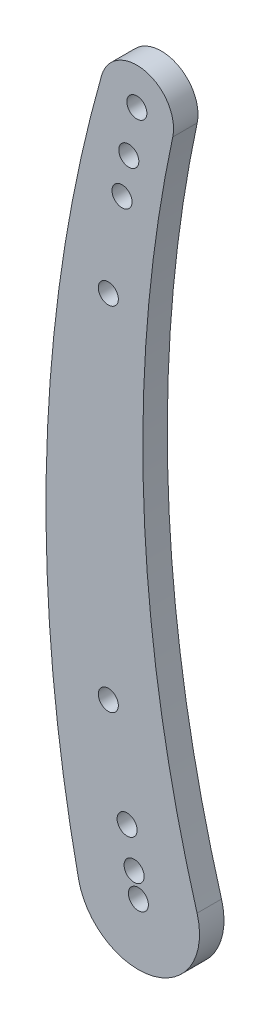
ISO-10303-21;
HEADER;
FILE_DESCRIPTION(('STEP AP214'),'2;1');
FILE_NAME('part.step','',(''),(''),'','','');
FILE_SCHEMA(('AUTOMOTIVE_DESIGN { 1 0 10303 214 1 1 1 1 }'));
ENDSEC;
DATA;
#1=APPLICATION_CONTEXT('core data for automotive mechanical design processes');
#2=APPLICATION_PROTOCOL_DEFINITION('international standard','automotive_design',2000,#1);
#3=PRODUCT_CONTEXT('',#1,'mechanical');
#4=PRODUCT('Part','Part','',(#3));
#5=PRODUCT_RELATED_PRODUCT_CATEGORY('part','',(#4));
#6=PRODUCT_DEFINITION_FORMATION('','',#4);
#7=PRODUCT_DEFINITION_CONTEXT('part definition',#1,'design');
#8=PRODUCT_DEFINITION('design','',#6,#7);
#9=PRODUCT_DEFINITION_SHAPE('','',#8);
#10=(LENGTH_UNIT() NAMED_UNIT(*) SI_UNIT(.MILLI.,.METRE.));
#11=(NAMED_UNIT(*) PLANE_ANGLE_UNIT() SI_UNIT($,.RADIAN.));
#12=(NAMED_UNIT(*) SI_UNIT($,.STERADIAN.) SOLID_ANGLE_UNIT());
#13=UNCERTAINTY_MEASURE_WITH_UNIT(LENGTH_MEASURE(1.E-05),#10,'distance_accuracy_value','');
#14=(GEOMETRIC_REPRESENTATION_CONTEXT(3) GLOBAL_UNCERTAINTY_ASSIGNED_CONTEXT((#13)) GLOBAL_UNIT_ASSIGNED_CONTEXT((#10,
#11,#12)) REPRESENTATION_CONTEXT('',''));
#15=CARTESIAN_POINT('',(0.,0.,0.));
#16=DIRECTION('',(0.,0.,1.));
#17=DIRECTION('',(1.,0.,0.));
#18=AXIS2_PLACEMENT_3D('',#15,#16,#17);
#19=CARTESIAN_POINT('',(137.957829025341,40.3943054231007,5.));
#20=DIRECTION('',(0.,0.,1.));
#21=DIRECTION('',(1.,0.,0.));
#22=AXIS2_PLACEMENT_3D('',#19,#20,#21);
#23=PLANE('',#22);
#24=CARTESIAN_POINT('',(-0.872956087167781,4.57842074080973,5.));
#25=DIRECTION('',(0.,0.,1.));
#26=DIRECTION('',(1.,0.,0.));
#27=AXIS2_PLACEMENT_3D('',#24,#25,#26);
#28=CIRCLE('',#27,2.04999999999999);
#29=CARTESIAN_POINT('',(1.17704391283221,4.57842074080973,5.));
#30=VERTEX_POINT('',#29);
#31=EDGE_CURVE('E157',#30,#30,#28,.T.);
#32=ORIENTED_EDGE('',*,*,#31,.F.);
#33=EDGE_LOOP('',(#32));
#34=FACE_BOUND('',#33,.T.);
#35=CARTESIAN_POINT('',(-2.30013225147478,12.0635772652943,5.));
#36=DIRECTION('',(0.,0.,1.));
#37=DIRECTION('',(1.,0.,0.));
#38=AXIS2_PLACEMENT_3D('',#35,#36,#37);
#39=CIRCLE('',#38,2.04999999999999);
#40=CARTESIAN_POINT('',(-0.250132251474789,12.0635772652943,5.));
#41=VERTEX_POINT('',#40);
#42=EDGE_CURVE('E154',#41,#41,#39,.T.);
#43=ORIENTED_EDGE('',*,*,#42,.F.);
#44=EDGE_LOOP('',(#43));
#45=FACE_BOUND('',#44,.T.);
#46=CARTESIAN_POINT('',(-1.95909243415583,130.643984382173,5.));
#47=DIRECTION('',(0.,0.,1.));
#48=DIRECTION('',(1.,0.,0.));
#49=AXIS2_PLACEMENT_3D('',#46,#47,#48);
#50=CIRCLE('',#49,2.05);
#51=CARTESIAN_POINT('',(0.090907565844173,130.643984382173,5.));
#52=VERTEX_POINT('',#51);
#53=EDGE_CURVE('E141',#52,#52,#50,.T.);
#54=ORIENTED_EDGE('',*,*,#53,.F.);
#55=EDGE_LOOP('',(#54));
#56=FACE_BOUND('',#55,.T.);
#57=CARTESIAN_POINT('',(-3.34827785549131,122.765522358075,5.));
#58=DIRECTION('',(0.,0.,1.));
#59=DIRECTION('',(1.,0.,0.));
#60=AXIS2_PLACEMENT_3D('',#57,#58,#59);
#61=CIRCLE('',#60,2.05);
#62=CARTESIAN_POINT('',(-1.29827785549131,122.765522358075,5.));
#63=VERTEX_POINT('',#62);
#64=EDGE_CURVE('E142',#63,#63,#61,.T.);
#65=ORIENTED_EDGE('',*,*,#64,.F.);
#66=EDGE_LOOP('',(#65));
#67=FACE_BOUND('',#66,.T.);
#68=CARTESIAN_POINT('',(-6.14211543162091,32.2137494634089,5.));
#69=DIRECTION('',(0.,0.,1.));
#70=DIRECTION('',(1.,0.,0.));
#71=AXIS2_PLACEMENT_3D('',#68,#69,#70);
#72=CIRCLE('',#71,2.05);
#73=CARTESIAN_POINT('',(-4.09211543162091,32.2137494634089,5.));
#74=VERTEX_POINT('',#73);
#75=EDGE_CURVE('E138',#74,#74,#72,.T.);
#76=ORIENTED_EDGE('',*,*,#75,.F.);
#77=EDGE_LOOP('',(#76));
#78=FACE_BOUND('',#77,.T.);
#79=CARTESIAN_POINT('',(-6.14211543162091,104.166670734742,5.));
#80=DIRECTION('',(0.,0.,1.));
#81=DIRECTION('',(1.,0.,0.));
#82=AXIS2_PLACEMENT_3D('',#79,#80,#81);
#83=CIRCLE('',#82,2.05);
#84=CARTESIAN_POINT('',(-4.09211543162091,104.166670734742,5.));
#85=VERTEX_POINT('',#84);
#86=EDGE_CURVE('E132',#85,#85,#83,.T.);
#87=ORIENTED_EDGE('',*,*,#86,.F.);
#88=EDGE_LOOP('',(#87));
#89=FACE_BOUND('',#88,.T.);
#90=CARTESIAN_POINT('',(0.,0.,5.));
#91=DIRECTION('',(0.,0.,1.));
#92=DIRECTION('',(1.,0.,0.));
#93=AXIS2_PLACEMENT_3D('',#90,#91,#92);
#94=CIRCLE('',#93,2.05);
#95=CARTESIAN_POINT('',(2.05,0.,5.));
#96=VERTEX_POINT('',#95);
#97=EDGE_CURVE('E106',#96,#96,#94,.T.);
#98=ORIENTED_EDGE('',*,*,#97,.F.);
#99=EDGE_LOOP('',(#98));
#100=FACE_BOUND('',#99,.T.);
#101=CARTESIAN_POINT('',(275.915658050682,80.7886108462015,5.));
#102=DIRECTION('',(0.,0.,-1.));
#103=DIRECTION('',(1.,0.,0.));
#104=AXIS2_PLACEMENT_3D('',#101,#102,#103);
#105=CIRCLE('',#104,275.);
#106=CARTESIAN_POINT('',(11.9963329587253,3.51254829766093,5.));
#107=VERTEX_POINT('',#106);
#108=CARTESIAN_POINT('',(7.02397479696329,138.42768333164,5.));
#109=VERTEX_POINT('',#108);
#110=EDGE_CURVE('E91',#107,#109,#105,.T.);
#111=ORIENTED_EDGE('',*,*,#110,.T.);
#112=CARTESIAN_POINT('',(-0.309434746319955,139.999658035789,5.));
#113=DIRECTION('',(0.,0.,1.));
#114=DIRECTION('',(1.,0.,0.));
#115=AXIS2_PLACEMENT_3D('',#112,#113,#114);
#116=CIRCLE('',#115,7.5);
#117=CARTESIAN_POINT('',(-7.52539193567164,142.044153533814,5.));
#118=VERTEX_POINT('',#117);
#119=EDGE_CURVE('E86',#109,#118,#116,.T.);
#120=ORIENTED_EDGE('',*,*,#119,.T.);
#121=CARTESIAN_POINT('',(281.112895638395,60.2643336128175,5.));
#122=DIRECTION('',(0.,0.,1.));
#123=DIRECTION('',(1.,0.,0.));
#124=AXIS2_PLACEMENT_3D('',#121,#122,#123);
#125=CIRCLE('',#124,300.);
#126=CARTESIAN_POINT('',(-12.222299810365,-2.62018841794858,5.));
#127=VERTEX_POINT('',#126);
#128=EDGE_CURVE('E89',#118,#127,#125,.T.);
#129=ORIENTED_EDGE('',*,*,#128,.T.);
#130=CARTESIAN_POINT('',(0.,0.,5.));
#131=DIRECTION('',(0.,0.,1.));
#132=DIRECTION('',(1.,0.,0.));
#133=AXIS2_PLACEMENT_3D('',#130,#131,#132);
#134=CIRCLE('',#133,12.5);
#135=EDGE_CURVE('E56',#127,#107,#134,.T.);
#136=ORIENTED_EDGE('',*,*,#135,.T.);
#137=EDGE_LOOP('',(#111,#120,#129,#136));
#138=FACE_BOUND('',#137,.T.);
#139=CARTESIAN_POINT('',(-0.309434746319955,139.999658035789,5.));
#140=DIRECTION('',(0.,0.,1.));
#141=DIRECTION('',(1.,0.,0.));
#142=AXIS2_PLACEMENT_3D('',#139,#140,#141);
#143=CIRCLE('',#142,2.05);
#144=CARTESIAN_POINT('',(1.74056525368004,139.999658035789,5.));
#145=VERTEX_POINT('',#144);
#146=EDGE_CURVE('E121',#145,#145,#143,.T.);
#147=ORIENTED_EDGE('',*,*,#146,.F.);
#148=EDGE_LOOP('',(#147));
#149=FACE_BOUND('',#148,.T.);
#150=ADVANCED_FACE('F39',(#34,#45,#56,#67,#78,#89,#100,#138,#149),#23,.T.);
#151=CARTESIAN_POINT('',(137.957829025341,40.3943054231007,0.));
#152=DIRECTION('',(0.,0.,1.));
#153=DIRECTION('',(1.,0.,0.));
#154=AXIS2_PLACEMENT_3D('',#151,#152,#153);
#155=PLANE('',#154);
#156=CARTESIAN_POINT('',(-0.872956087167781,4.57842074080973,0.));
#157=DIRECTION('',(0.,0.,1.));
#158=DIRECTION('',(1.,0.,0.));
#159=AXIS2_PLACEMENT_3D('',#156,#157,#158);
#160=CIRCLE('',#159,2.04999999999999);
#161=CARTESIAN_POINT('',(1.17704391283221,4.57842074080973,0.));
#162=VERTEX_POINT('',#161);
#163=EDGE_CURVE('E149',#162,#162,#160,.F.);
#164=ORIENTED_EDGE('',*,*,#163,.F.);
#165=EDGE_LOOP('',(#164));
#166=FACE_BOUND('',#165,.T.);
#167=CARTESIAN_POINT('',(-2.30013225147478,12.0635772652943,0.));
#168=DIRECTION('',(0.,0.,1.));
#169=DIRECTION('',(1.,0.,0.));
#170=AXIS2_PLACEMENT_3D('',#167,#168,#169);
#171=CIRCLE('',#170,2.04999999999999);
#172=CARTESIAN_POINT('',(-0.250132251474789,12.0635772652943,0.));
#173=VERTEX_POINT('',#172);
#174=EDGE_CURVE('E158',#173,#173,#171,.F.);
#175=ORIENTED_EDGE('',*,*,#174,.F.);
#176=EDGE_LOOP('',(#175));
#177=FACE_BOUND('',#176,.T.);
#178=CARTESIAN_POINT('',(-1.95909243415583,130.643984382173,0.));
#179=DIRECTION('',(0.,0.,1.));
#180=DIRECTION('',(1.,0.,0.));
#181=AXIS2_PLACEMENT_3D('',#178,#179,#180);
#182=CIRCLE('',#181,2.05);
#183=CARTESIAN_POINT('',(0.090907565844173,130.643984382173,0.));
#184=VERTEX_POINT('',#183);
#185=EDGE_CURVE('E145',#184,#184,#182,.F.);
#186=ORIENTED_EDGE('',*,*,#185,.F.);
#187=EDGE_LOOP('',(#186));
#188=FACE_BOUND('',#187,.T.);
#189=CARTESIAN_POINT('',(-3.34827785549131,122.765522358075,0.));
#190=DIRECTION('',(0.,0.,1.));
#191=DIRECTION('',(1.,0.,0.));
#192=AXIS2_PLACEMENT_3D('',#189,#190,#191);
#193=CIRCLE('',#192,2.05);
#194=CARTESIAN_POINT('',(-1.29827785549131,122.765522358075,0.));
#195=VERTEX_POINT('',#194);
#196=EDGE_CURVE('E146',#195,#195,#193,.F.);
#197=ORIENTED_EDGE('',*,*,#196,.F.);
#198=EDGE_LOOP('',(#197));
#199=FACE_BOUND('',#198,.T.);
#200=CARTESIAN_POINT('',(-6.14211543162091,32.2137494634089,0.));
#201=DIRECTION('',(0.,0.,1.));
#202=DIRECTION('',(1.,0.,0.));
#203=AXIS2_PLACEMENT_3D('',#200,#201,#202);
#204=CIRCLE('',#203,2.05);
#205=CARTESIAN_POINT('',(-4.09211543162091,32.2137494634089,0.));
#206=VERTEX_POINT('',#205);
#207=EDGE_CURVE('E135',#206,#206,#204,.F.);
#208=ORIENTED_EDGE('',*,*,#207,.F.);
#209=EDGE_LOOP('',(#208));
#210=FACE_BOUND('',#209,.T.);
#211=CARTESIAN_POINT('',(-6.14211543162091,104.166670734742,0.));
#212=DIRECTION('',(0.,0.,1.));
#213=DIRECTION('',(1.,0.,0.));
#214=AXIS2_PLACEMENT_3D('',#211,#212,#213);
#215=CIRCLE('',#214,2.05);
#216=CARTESIAN_POINT('',(-4.09211543162091,104.166670734742,0.));
#217=VERTEX_POINT('',#216);
#218=EDGE_CURVE('E127',#217,#217,#215,.F.);
#219=ORIENTED_EDGE('',*,*,#218,.F.);
#220=EDGE_LOOP('',(#219));
#221=FACE_BOUND('',#220,.T.);
#222=CARTESIAN_POINT('',(275.915658050682,80.7886108462015,0.));
#223=DIRECTION('',(0.,0.,-1.));
#224=DIRECTION('',(1.,0.,0.));
#225=AXIS2_PLACEMENT_3D('',#222,#223,#224);
#226=CIRCLE('',#225,275.);
#227=CARTESIAN_POINT('',(11.9963329587253,3.51254829766093,0.));
#228=VERTEX_POINT('',#227);
#229=CARTESIAN_POINT('',(7.02397479696329,138.42768333164,0.));
#230=VERTEX_POINT('',#229);
#231=EDGE_CURVE('E103',#228,#230,#226,.T.);
#232=ORIENTED_EDGE('',*,*,#231,.F.);
#233=CARTESIAN_POINT('',(0.,0.,0.));
#234=DIRECTION('',(0.,0.,1.));
#235=DIRECTION('',(1.,0.,0.));
#236=AXIS2_PLACEMENT_3D('',#233,#234,#235);
#237=CIRCLE('',#236,12.5);
#238=CARTESIAN_POINT('',(-12.222299810365,-2.62018841794858,0.));
#239=VERTEX_POINT('',#238);
#240=EDGE_CURVE('E79',#239,#228,#237,.T.);
#241=ORIENTED_EDGE('',*,*,#240,.F.);
#242=CARTESIAN_POINT('',(281.112895638395,60.2643336128175,0.));
#243=DIRECTION('',(0.,0.,1.));
#244=DIRECTION('',(1.,0.,0.));
#245=AXIS2_PLACEMENT_3D('',#242,#243,#244);
#246=CIRCLE('',#245,300.);
#247=CARTESIAN_POINT('',(-7.52539193567164,142.044153533814,0.));
#248=VERTEX_POINT('',#247);
#249=EDGE_CURVE('E73',#248,#239,#246,.T.);
#250=ORIENTED_EDGE('',*,*,#249,.F.);
#251=CARTESIAN_POINT('',(-0.309434746319955,139.999658035789,0.));
#252=DIRECTION('',(0.,0.,1.));
#253=DIRECTION('',(1.,0.,0.));
#254=AXIS2_PLACEMENT_3D('',#251,#252,#253);
#255=CIRCLE('',#254,7.5);
#256=EDGE_CURVE('E95',#230,#248,#255,.T.);
#257=ORIENTED_EDGE('',*,*,#256,.F.);
#258=EDGE_LOOP('',(#232,#241,#250,#257));
#259=FACE_BOUND('',#258,.T.);
#260=CARTESIAN_POINT('',(0.,0.,0.));
#261=DIRECTION('',(0.,0.,1.));
#262=DIRECTION('',(1.,0.,0.));
#263=AXIS2_PLACEMENT_3D('',#260,#261,#262);
#264=CIRCLE('',#263,2.05);
#265=CARTESIAN_POINT('',(2.05,0.,0.));
#266=VERTEX_POINT('',#265);
#267=EDGE_CURVE('E118',#266,#266,#264,.T.);
#268=ORIENTED_EDGE('',*,*,#267,.T.);
#269=EDGE_LOOP('',(#268));
#270=FACE_BOUND('',#269,.T.);
#271=CARTESIAN_POINT('',(-0.309434746319955,139.999658035789,0.));
#272=DIRECTION('',(0.,0.,1.));
#273=DIRECTION('',(1.,0.,0.));
#274=AXIS2_PLACEMENT_3D('',#271,#272,#273);
#275=CIRCLE('',#274,2.05);
#276=CARTESIAN_POINT('',(1.74056525368004,139.999658035789,0.));
#277=VERTEX_POINT('',#276);
#278=EDGE_CURVE('E124',#277,#277,#275,.T.);
#279=ORIENTED_EDGE('',*,*,#278,.T.);
#280=EDGE_LOOP('',(#279));
#281=FACE_BOUND('',#280,.T.);
#282=ADVANCED_FACE('F114',(#166,#177,#188,#199,#210,#221,#259,#270,#281),#155,.F.);
#283=CARTESIAN_POINT('',(275.915658050682,80.7886108462015,5.));
#284=DIRECTION('',(0.,0.,-1.));
#285=DIRECTION('',(-1.,0.,0.));
#286=AXIS2_PLACEMENT_3D('',#283,#284,#285);
#287=CYLINDRICAL_SURFACE('',#286,275.);
#288=ORIENTED_EDGE('',*,*,#231,.T.);
#289=DIRECTION('',(0.,0.,-1.));
#290=VECTOR('',#289,1.);
#291=CARTESIAN_POINT('',(7.02397479696329,138.42768333164,5.));
#292=LINE('',#291,#290);
#293=EDGE_CURVE('E11',#109,#230,#292,.T.);
#294=ORIENTED_EDGE('',*,*,#293,.F.);
#295=ORIENTED_EDGE('',*,*,#110,.F.);
#296=DIRECTION('',(0.,0.,-1.));
#297=VECTOR('',#296,1.);
#298=CARTESIAN_POINT('',(11.9963329587253,3.51254829766093,5.));
#299=LINE('',#298,#297);
#300=EDGE_CURVE('E99',#107,#228,#299,.T.);
#301=ORIENTED_EDGE('',*,*,#300,.T.);
#302=EDGE_LOOP('',(#288,#294,#295,#301));
#303=FACE_BOUND('',#302,.T.);
#304=ADVANCED_FACE('F41',(#303),#287,.F.);
#305=CARTESIAN_POINT('',(-0.309434746319955,139.999658035789,5.));
#306=DIRECTION('',(0.,0.,-1.));
#307=DIRECTION('',(-1.,0.,0.));
#308=AXIS2_PLACEMENT_3D('',#305,#306,#307);
#309=CYLINDRICAL_SURFACE('',#308,7.5);
#310=ORIENTED_EDGE('',*,*,#256,.T.);
#311=DIRECTION('',(0.,0.,-1.));
#312=VECTOR('',#311,1.);
#313=CARTESIAN_POINT('',(-7.52539193567164,142.044153533814,5.));
#314=LINE('',#313,#312);
#315=EDGE_CURVE('E48',#118,#248,#314,.T.);
#316=ORIENTED_EDGE('',*,*,#315,.F.);
#317=ORIENTED_EDGE('',*,*,#119,.F.);
#318=ORIENTED_EDGE('',*,*,#293,.T.);
#319=EDGE_LOOP('',(#310,#316,#317,#318));
#320=FACE_BOUND('',#319,.T.);
#321=ADVANCED_FACE('F94',(#320),#309,.T.);
#322=CARTESIAN_POINT('',(281.112895638395,60.2643336128175,5.));
#323=DIRECTION('',(0.,0.,-1.));
#324=DIRECTION('',(-1.,0.,0.));
#325=AXIS2_PLACEMENT_3D('',#322,#323,#324);
#326=CYLINDRICAL_SURFACE('',#325,300.);
#327=ORIENTED_EDGE('',*,*,#249,.T.);
#328=DIRECTION('',(0.,0.,-1.));
#329=VECTOR('',#328,1.);
#330=CARTESIAN_POINT('',(-12.222299810365,-2.62018841794858,5.));
#331=LINE('',#330,#329);
#332=EDGE_CURVE('E96',#127,#239,#331,.T.);
#333=ORIENTED_EDGE('',*,*,#332,.F.);
#334=ORIENTED_EDGE('',*,*,#128,.F.);
#335=ORIENTED_EDGE('',*,*,#315,.T.);
#336=EDGE_LOOP('',(#327,#333,#334,#335));
#337=FACE_BOUND('',#336,.T.);
#338=ADVANCED_FACE('F97',(#337),#326,.T.);
#339=CARTESIAN_POINT('',(0.,0.,5.));
#340=DIRECTION('',(0.,0.,-1.));
#341=DIRECTION('',(-1.,0.,0.));
#342=AXIS2_PLACEMENT_3D('',#339,#340,#341);
#343=CYLINDRICAL_SURFACE('',#342,12.5);
#344=ORIENTED_EDGE('',*,*,#240,.T.);
#345=ORIENTED_EDGE('',*,*,#300,.F.);
#346=ORIENTED_EDGE('',*,*,#135,.F.);
#347=ORIENTED_EDGE('',*,*,#332,.T.);
#348=EDGE_LOOP('',(#344,#345,#346,#347));
#349=FACE_BOUND('',#348,.T.);
#350=ADVANCED_FACE('F111',(#349),#343,.T.);
#351=CARTESIAN_POINT('',(0.,0.,5.));
#352=DIRECTION('',(0.,0.,-1.));
#353=DIRECTION('',(-1.,0.,0.));
#354=AXIS2_PLACEMENT_3D('',#351,#352,#353);
#355=CYLINDRICAL_SURFACE('',#354,2.05);
#356=ORIENTED_EDGE('',*,*,#97,.T.);
#357=EDGE_LOOP('',(#356));
#358=FACE_BOUND('',#357,.T.);
#359=ORIENTED_EDGE('',*,*,#267,.F.);
#360=EDGE_LOOP('',(#359));
#361=FACE_BOUND('',#360,.T.);
#362=ADVANCED_FACE('F184',(#358,#361),#355,.F.);
#363=CARTESIAN_POINT('',(-0.309434746319955,139.999658035789,5.));
#364=DIRECTION('',(0.,0.,-1.));
#365=DIRECTION('',(-1.,0.,0.));
#366=AXIS2_PLACEMENT_3D('',#363,#364,#365);
#367=CYLINDRICAL_SURFACE('',#366,2.05);
#368=ORIENTED_EDGE('',*,*,#146,.T.);
#369=EDGE_LOOP('',(#368));
#370=FACE_BOUND('',#369,.T.);
#371=ORIENTED_EDGE('',*,*,#278,.F.);
#372=EDGE_LOOP('',(#371));
#373=FACE_BOUND('',#372,.T.);
#374=ADVANCED_FACE('F187',(#370,#373),#367,.F.);
#375=CARTESIAN_POINT('',(-6.14211543162091,104.166670734742,-0.00100000000000013));
#376=DIRECTION('',(0.,0.,1.));
#377=DIRECTION('',(1.,0.,0.));
#378=AXIS2_PLACEMENT_3D('',#375,#376,#377);
#379=CYLINDRICAL_SURFACE('',#378,2.05);
#380=ORIENTED_EDGE('',*,*,#86,.T.);
#381=EDGE_LOOP('',(#380));
#382=FACE_BOUND('',#381,.T.);
#383=ORIENTED_EDGE('',*,*,#218,.T.);
#384=EDGE_LOOP('',(#383));
#385=FACE_BOUND('',#384,.T.);
#386=ADVANCED_FACE('F197',(#382,#385),#379,.F.);
#387=CARTESIAN_POINT('',(-6.14211543162091,32.2137494634089,-0.00100000000000013));
#388=DIRECTION('',(0.,0.,1.));
#389=DIRECTION('',(1.,0.,0.));
#390=AXIS2_PLACEMENT_3D('',#387,#388,#389);
#391=CYLINDRICAL_SURFACE('',#390,2.05);
#392=ORIENTED_EDGE('',*,*,#75,.T.);
#393=EDGE_LOOP('',(#392));
#394=FACE_BOUND('',#393,.T.);
#395=ORIENTED_EDGE('',*,*,#207,.T.);
#396=EDGE_LOOP('',(#395));
#397=FACE_BOUND('',#396,.T.);
#398=ADVANCED_FACE('F203',(#394,#397),#391,.F.);
#399=CARTESIAN_POINT('',(-3.34827785549131,122.765522358075,-0.00100000000000013));
#400=DIRECTION('',(0.,0.,1.));
#401=DIRECTION('',(1.,0.,0.));
#402=AXIS2_PLACEMENT_3D('',#399,#400,#401);
#403=CYLINDRICAL_SURFACE('',#402,2.05);
#404=ORIENTED_EDGE('',*,*,#64,.T.);
#405=EDGE_LOOP('',(#404));
#406=FACE_BOUND('',#405,.T.);
#407=ORIENTED_EDGE('',*,*,#196,.T.);
#408=EDGE_LOOP('',(#407));
#409=FACE_BOUND('',#408,.T.);
#410=ADVANCED_FACE('F241',(#406,#409),#403,.F.);
#411=CARTESIAN_POINT('',(-1.95909243415583,130.643984382173,-0.00100000000000013));
#412=DIRECTION('',(0.,0.,1.));
#413=DIRECTION('',(1.,0.,0.));
#414=AXIS2_PLACEMENT_3D('',#411,#412,#413);
#415=CYLINDRICAL_SURFACE('',#414,2.05);
#416=ORIENTED_EDGE('',*,*,#53,.T.);
#417=EDGE_LOOP('',(#416));
#418=FACE_BOUND('',#417,.T.);
#419=ORIENTED_EDGE('',*,*,#185,.T.);
#420=EDGE_LOOP('',(#419));
#421=FACE_BOUND('',#420,.T.);
#422=ADVANCED_FACE('F235',(#418,#421),#415,.F.);
#423=CARTESIAN_POINT('',(-2.30013225147478,12.0635772652943,-0.00100000000000013));
#424=DIRECTION('',(0.,0.,1.));
#425=DIRECTION('',(1.,0.,0.));
#426=AXIS2_PLACEMENT_3D('',#423,#424,#425);
#427=CYLINDRICAL_SURFACE('',#426,2.04999999999999);
#428=ORIENTED_EDGE('',*,*,#42,.T.);
#429=EDGE_LOOP('',(#428));
#430=FACE_BOUND('',#429,.T.);
#431=ORIENTED_EDGE('',*,*,#174,.T.);
#432=EDGE_LOOP('',(#431));
#433=FACE_BOUND('',#432,.T.);
#434=ADVANCED_FACE('F240',(#430,#433),#427,.F.);
#435=CARTESIAN_POINT('',(-0.872956087167781,4.57842074080973,-0.00100000000000013));
#436=DIRECTION('',(0.,0.,1.));
#437=DIRECTION('',(1.,0.,0.));
#438=AXIS2_PLACEMENT_3D('',#435,#436,#437);
#439=CYLINDRICAL_SURFACE('',#438,2.04999999999999);
#440=ORIENTED_EDGE('',*,*,#31,.T.);
#441=EDGE_LOOP('',(#440));
#442=FACE_BOUND('',#441,.T.);
#443=ORIENTED_EDGE('',*,*,#163,.T.);
#444=EDGE_LOOP('',(#443));
#445=FACE_BOUND('',#444,.T.);
#446=ADVANCED_FACE('F166',(#442,#445),#439,.F.);
#447=CLOSED_SHELL('',(#150,#282,#304,#321,#338,#350,#362,#374,#386,#398,#410,#422,#434,#446));
#448=MANIFOLD_SOLID_BREP('B2',#447);
#449=ADVANCED_BREP_SHAPE_REPRESENTATION('',(#18,#448),#14);
#450=SHAPE_DEFINITION_REPRESENTATION(#9,#449);
ENDSEC;
END-ISO-10303-21;
